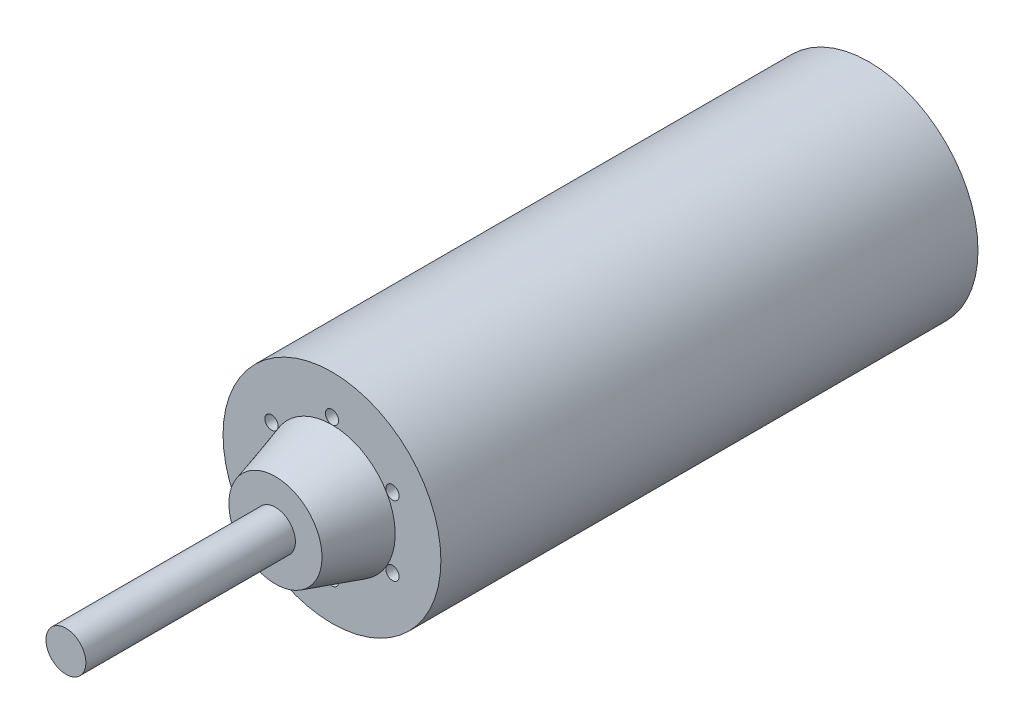
ISO-10303-21;
HEADER;
FILE_DESCRIPTION(('STEP AP214'),'2;1');
FILE_NAME('part.step','',(''),(''),'','','');
FILE_SCHEMA(('AUTOMOTIVE_DESIGN { 1 0 10303 214 1 1 1 1 }'));
ENDSEC;
DATA;
#1=APPLICATION_CONTEXT('core data for automotive mechanical design processes');
#2=APPLICATION_PROTOCOL_DEFINITION('international standard','automotive_design',2000,#1);
#3=PRODUCT_CONTEXT('',#1,'mechanical');
#4=PRODUCT('Part','Part','',(#3));
#5=PRODUCT_RELATED_PRODUCT_CATEGORY('part','',(#4));
#6=PRODUCT_DEFINITION_FORMATION('','',#4);
#7=PRODUCT_DEFINITION_CONTEXT('part definition',#1,'design');
#8=PRODUCT_DEFINITION('design','',#6,#7);
#9=PRODUCT_DEFINITION_SHAPE('','',#8);
#10=(LENGTH_UNIT() NAMED_UNIT(*) SI_UNIT(.MILLI.,.METRE.));
#11=(NAMED_UNIT(*) PLANE_ANGLE_UNIT() SI_UNIT($,.RADIAN.));
#12=(NAMED_UNIT(*) SI_UNIT($,.STERADIAN.) SOLID_ANGLE_UNIT());
#13=UNCERTAINTY_MEASURE_WITH_UNIT(LENGTH_MEASURE(1.E-05),#10,'distance_accuracy_value','');
#14=(GEOMETRIC_REPRESENTATION_CONTEXT(3) GLOBAL_UNCERTAINTY_ASSIGNED_CONTEXT((#13)) GLOBAL_UNIT_ASSIGNED_CONTEXT((#10,
#11,#12)) REPRESENTATION_CONTEXT('',''));
#15=CARTESIAN_POINT('',(0.,0.,0.));
#16=DIRECTION('',(0.,0.,1.));
#17=DIRECTION('',(1.,0.,0.));
#18=AXIS2_PLACEMENT_3D('',#15,#16,#17);
#19=CARTESIAN_POINT('',(0.,0.,-80.75));
#20=DIRECTION('',(0.,0.,1.));
#21=DIRECTION('',(1.,0.,0.));
#22=AXIS2_PLACEMENT_3D('',#19,#20,#21);
#23=CYLINDRICAL_SURFACE('',#22,32.75);
#24=CARTESIAN_POINT('',(0.,0.,-80.75));
#25=DIRECTION('',(0.,0.,1.));
#26=DIRECTION('',(1.,0.,0.));
#27=AXIS2_PLACEMENT_3D('',#24,#25,#26);
#28=CIRCLE('',#27,32.75);
#29=CARTESIAN_POINT('',(32.75,0.,-80.75));
#30=VERTEX_POINT('',#29);
#31=EDGE_CURVE('E83',#30,#30,#28,.T.);
#32=ORIENTED_EDGE('',*,*,#31,.T.);
#33=EDGE_LOOP('',(#32));
#34=FACE_BOUND('',#33,.T.);
#35=CARTESIAN_POINT('',(0.,0.,80.75));
#36=DIRECTION('',(0.,0.,1.));
#37=DIRECTION('',(1.,0.,0.));
#38=AXIS2_PLACEMENT_3D('',#35,#36,#37);
#39=CIRCLE('',#38,32.75);
#40=CARTESIAN_POINT('',(32.75,0.,80.75));
#41=VERTEX_POINT('',#40);
#42=EDGE_CURVE('E41',#41,#41,#39,.T.);
#43=ORIENTED_EDGE('',*,*,#42,.F.);
#44=EDGE_LOOP('',(#43));
#45=FACE_BOUND('',#44,.T.);
#46=ADVANCED_FACE('F38',(#34,#45),#23,.T.);
#47=CARTESIAN_POINT('',(0.,0.,-80.75));
#48=DIRECTION('',(0.,0.,1.));
#49=DIRECTION('',(1.,0.,0.));
#50=AXIS2_PLACEMENT_3D('',#47,#48,#49);
#51=PLANE('',#50);
#52=CARTESIAN_POINT('',(-14.8492424049174,-14.8492424049175,-80.75));
#53=DIRECTION('',(0.,0.,-1.));
#54=DIRECTION('',(0.,-1.,0.));
#55=AXIS2_PLACEMENT_3D('',#52,#53,#54);
#56=CIRCLE('',#55,2.5);
#57=CARTESIAN_POINT('',(-14.8492424049174,-17.3492424049175,-80.75));
#58=VERTEX_POINT('',#57);
#59=EDGE_CURVE('E226',#58,#58,#56,.T.);
#60=ORIENTED_EDGE('',*,*,#59,.F.);
#61=EDGE_LOOP('',(#60));
#62=FACE_BOUND('',#61,.T.);
#63=CARTESIAN_POINT('',(14.8492424049175,-14.8492424049175,-80.75));
#64=DIRECTION('',(0.,0.,-1.));
#65=DIRECTION('',(1.,0.,0.));
#66=AXIS2_PLACEMENT_3D('',#63,#64,#65);
#67=CIRCLE('',#66,2.5);
#68=CARTESIAN_POINT('',(17.3492424049175,-14.8492424049175,-80.75));
#69=VERTEX_POINT('',#68);
#70=EDGE_CURVE('E237',#69,#69,#67,.T.);
#71=ORIENTED_EDGE('',*,*,#70,.F.);
#72=EDGE_LOOP('',(#71));
#73=FACE_BOUND('',#72,.T.);
#74=CARTESIAN_POINT('',(14.8492424049173,14.8492424049177,-80.75));
#75=DIRECTION('',(0.,0.,-1.));
#76=DIRECTION('',(0.,1.,0.));
#77=AXIS2_PLACEMENT_3D('',#74,#75,#76);
#78=CIRCLE('',#77,2.5);
#79=CARTESIAN_POINT('',(14.8492424049173,17.3492424049177,-80.75));
#80=VERTEX_POINT('',#79);
#81=EDGE_CURVE('E243',#80,#80,#78,.T.);
#82=ORIENTED_EDGE('',*,*,#81,.F.);
#83=EDGE_LOOP('',(#82));
#84=FACE_BOUND('',#83,.T.);
#85=CARTESIAN_POINT('',(-14.8492424049175,14.8492424049175,-80.75));
#86=DIRECTION('',(0.,0.,-1.));
#87=DIRECTION('',(-1.,0.,0.));
#88=AXIS2_PLACEMENT_3D('',#85,#86,#87);
#89=CIRCLE('',#88,2.5);
#90=CARTESIAN_POINT('',(-17.3492424049175,14.8492424049175,-80.75));
#91=VERTEX_POINT('',#90);
#92=EDGE_CURVE('E225',#91,#91,#89,.T.);
#93=ORIENTED_EDGE('',*,*,#92,.F.);
#94=EDGE_LOOP('',(#93));
#95=FACE_BOUND('',#94,.T.);
#96=ORIENTED_EDGE('',*,*,#31,.F.);
#97=EDGE_LOOP('',(#96));
#98=FACE_BOUND('',#97,.T.);
#99=ADVANCED_FACE('F113',(#62,#73,#84,#95,#98),#51,.F.);
#100=CARTESIAN_POINT('',(0.,0.,80.75));
#101=DIRECTION('',(0.,0.,1.));
#102=DIRECTION('',(1.,0.,0.));
#103=AXIS2_PLACEMENT_3D('',#100,#101,#102);
#104=PLANE('',#103);
#105=CARTESIAN_POINT('',(0.,0.,80.75));
#106=DIRECTION('',(0.,0.,1.));
#107=DIRECTION('',(1.,0.,0.));
#108=AXIS2_PLACEMENT_3D('',#105,#106,#107);
#109=CIRCLE('',#108,19.);
#110=CARTESIAN_POINT('',(16.4544826719042,9.50000000000025,80.75));
#111=VERTEX_POINT('',#110);
#112=CARTESIAN_POINT('',(0.,19.,80.75));
#113=VERTEX_POINT('',#112);
#114=EDGE_CURVE('E73',#111,#113,#109,.T.);
#115=ORIENTED_EDGE('',*,*,#114,.F.);
#116=CARTESIAN_POINT('',(18.1865334794731,10.5000000000003,80.75));
#117=DIRECTION('',(0.,0.,1.));
#118=DIRECTION('',(0.50000000000001,-0.866025403784433,0.));
#119=AXIS2_PLACEMENT_3D('',#116,#117,#118);
#120=CIRCLE('',#119,2.);
#121=EDGE_CURVE('E52',#111,#111,#120,.T.);
#122=ORIENTED_EDGE('',*,*,#121,.F.);
#123=CARTESIAN_POINT('',(16.4544826719045,-9.49999999999979,80.75));
#124=VERTEX_POINT('',#123);
#125=EDGE_CURVE('E80',#124,#111,#109,.T.);
#126=ORIENTED_EDGE('',*,*,#125,.F.);
#127=CARTESIAN_POINT('',(18.1865334794733,-10.4999999999998,80.75));
#128=DIRECTION('',(0.,0.,1.));
#129=DIRECTION('',(-0.499999999999992,-0.866025403784443,0.));
#130=AXIS2_PLACEMENT_3D('',#127,#128,#129);
#131=CIRCLE('',#130,2.);
#132=EDGE_CURVE('E57',#124,#124,#131,.T.);
#133=ORIENTED_EDGE('',*,*,#132,.F.);
#134=CARTESIAN_POINT('',(0.,-19.,80.75));
#135=VERTEX_POINT('',#134);
#136=EDGE_CURVE('E272',#135,#124,#109,.T.);
#137=ORIENTED_EDGE('',*,*,#136,.F.);
#138=CARTESIAN_POINT('',(0.,-21.,80.75));
#139=DIRECTION('',(0.,0.,1.));
#140=DIRECTION('',(-1.,0.,0.));
#141=AXIS2_PLACEMENT_3D('',#138,#139,#140);
#142=CIRCLE('',#141,2.);
#143=EDGE_CURVE('E256',#135,#135,#142,.T.);
#144=ORIENTED_EDGE('',*,*,#143,.F.);
#145=CARTESIAN_POINT('',(-16.4544826719043,-9.50000000000014,80.75));
#146=VERTEX_POINT('',#145);
#147=EDGE_CURVE('E271',#146,#135,#109,.T.);
#148=ORIENTED_EDGE('',*,*,#147,.F.);
#149=CARTESIAN_POINT('',(-18.1865334794731,-10.5000000000001,80.75));
#150=DIRECTION('',(0.,0.,1.));
#151=DIRECTION('',(-0.500000000000004,0.866025403784436,0.));
#152=AXIS2_PLACEMENT_3D('',#149,#150,#151);
#153=CIRCLE('',#152,2.);
#154=EDGE_CURVE('E251',#146,#146,#153,.T.);
#155=ORIENTED_EDGE('',*,*,#154,.F.);
#156=CARTESIAN_POINT('',(-16.4544826719044,9.49999999999991,80.75));
#157=VERTEX_POINT('',#156);
#158=EDGE_CURVE('E102',#157,#146,#109,.T.);
#159=ORIENTED_EDGE('',*,*,#158,.F.);
#160=CARTESIAN_POINT('',(-18.1865334794733,10.4999999999999,80.75));
#161=DIRECTION('',(0.,0.,1.));
#162=DIRECTION('',(0.499999999999998,0.86602540378444,0.));
#163=AXIS2_PLACEMENT_3D('',#160,#161,#162);
#164=CIRCLE('',#163,2.);
#165=EDGE_CURVE('E95',#157,#157,#164,.T.);
#166=ORIENTED_EDGE('',*,*,#165,.F.);
#167=EDGE_CURVE('E46',#113,#157,#109,.T.);
#168=ORIENTED_EDGE('',*,*,#167,.F.);
#169=CARTESIAN_POINT('',(0.,21.,80.75));
#170=DIRECTION('',(0.,0.,1.));
#171=DIRECTION('',(1.,0.,0.));
#172=AXIS2_PLACEMENT_3D('',#169,#170,#171);
#173=CIRCLE('',#172,2.);
#174=EDGE_CURVE('E86',#113,#113,#173,.T.);
#175=ORIENTED_EDGE('',*,*,#174,.F.);
#176=EDGE_LOOP('',(#115,#122,#126,#133,#137,#144,#148,#155,#159,#166,#168,#175));
#177=FACE_BOUND('',#176,.T.);
#178=ORIENTED_EDGE('',*,*,#42,.T.);
#179=EDGE_LOOP('',(#178));
#180=FACE_BOUND('',#179,.T.);
#181=ADVANCED_FACE('F110',(#177,#180),#104,.T.);
#182=CARTESIAN_POINT('',(0.,0.,97.75));
#183=DIRECTION('',(0.,0.,-1.));
#184=DIRECTION('',(-1.,0.,0.));
#185=AXIS2_PLACEMENT_3D('',#182,#183,#184);
#186=PLANE('',#185);
#187=CARTESIAN_POINT('',(0.,0.,97.75));
#188=DIRECTION('',(0.,0.,1.));
#189=DIRECTION('',(1.,0.,0.));
#190=AXIS2_PLACEMENT_3D('',#187,#188,#189);
#191=CIRCLE('',#190,6.);
#192=CARTESIAN_POINT('',(6.,0.,97.75));
#193=VERTEX_POINT('',#192);
#194=EDGE_CURVE('E11',#193,#193,#191,.T.);
#195=ORIENTED_EDGE('',*,*,#194,.F.);
#196=EDGE_LOOP('',(#195));
#197=FACE_BOUND('',#196,.T.);
#198=CARTESIAN_POINT('',(0.,0.,97.75));
#199=DIRECTION('',(0.,0.,1.));
#200=DIRECTION('',(1.,0.,0.));
#201=AXIS2_PLACEMENT_3D('',#198,#199,#200);
#202=CIRCLE('',#201,14.);
#203=CARTESIAN_POINT('',(14.,0.,97.75));
#204=VERTEX_POINT('',#203);
#205=EDGE_CURVE('E100',#204,#204,#202,.T.);
#206=ORIENTED_EDGE('',*,*,#205,.T.);
#207=EDGE_LOOP('',(#206));
#208=FACE_BOUND('',#207,.T.);
#209=ADVANCED_FACE('F124',(#197,#208),#186,.F.);
#210=CARTESIAN_POINT('',(0.,0.,80.75));
#211=DIRECTION('',(0.,0.,-1.));
#212=DIRECTION('',(-1.,0.,0.));
#213=AXIS2_PLACEMENT_3D('',#210,#211,#212);
#214=CONICAL_SURFACE('',#213,19.,0.286051441717318);
#215=ORIENTED_EDGE('',*,*,#205,.F.);
#216=EDGE_LOOP('',(#215));
#217=FACE_BOUND('',#216,.T.);
#218=ORIENTED_EDGE('',*,*,#167,.T.);
#219=ORIENTED_EDGE('',*,*,#158,.T.);
#220=ORIENTED_EDGE('',*,*,#147,.T.);
#221=ORIENTED_EDGE('',*,*,#136,.T.);
#222=ORIENTED_EDGE('',*,*,#125,.T.);
#223=ORIENTED_EDGE('',*,*,#114,.T.);
#224=EDGE_LOOP('',(#218,#219,#220,#221,#222,#223));
#225=FACE_BOUND('',#224,.T.);
#226=ADVANCED_FACE('F75',(#217,#225),#214,.T.);
#227=CARTESIAN_POINT('',(0.,0.,160.75));
#228=DIRECTION('',(0.,0.,-1.));
#229=DIRECTION('',(-1.,0.,0.));
#230=AXIS2_PLACEMENT_3D('',#227,#228,#229);
#231=CYLINDRICAL_SURFACE('',#230,6.);
#232=CARTESIAN_POINT('',(0.,0.,160.75));
#233=DIRECTION('',(0.,0.,1.));
#234=DIRECTION('',(1.,0.,0.));
#235=AXIS2_PLACEMENT_3D('',#232,#233,#234);
#236=CIRCLE('',#235,6.);
#237=CARTESIAN_POINT('',(6.,0.,160.75));
#238=VERTEX_POINT('',#237);
#239=EDGE_CURVE('E92',#238,#238,#236,.T.);
#240=ORIENTED_EDGE('',*,*,#239,.F.);
#241=EDGE_LOOP('',(#240));
#242=FACE_BOUND('',#241,.T.);
#243=ORIENTED_EDGE('',*,*,#194,.T.);
#244=EDGE_LOOP('',(#243));
#245=FACE_BOUND('',#244,.T.);
#246=ADVANCED_FACE('F133',(#242,#245),#231,.T.);
#247=CARTESIAN_POINT('',(0.,0.,160.75));
#248=DIRECTION('',(0.,0.,1.));
#249=DIRECTION('',(1.,0.,0.));
#250=AXIS2_PLACEMENT_3D('',#247,#248,#249);
#251=PLANE('',#250);
#252=ORIENTED_EDGE('',*,*,#239,.T.);
#253=EDGE_LOOP('',(#252));
#254=FACE_BOUND('',#253,.T.);
#255=ADVANCED_FACE('F137',(#254),#251,.T.);
#256=CARTESIAN_POINT('',(0.,21.,70.75));
#257=DIRECTION('',(0.,0.,1.));
#258=DIRECTION('',(1.,0.,0.));
#259=AXIS2_PLACEMENT_3D('',#256,#257,#258);
#260=CYLINDRICAL_SURFACE('',#259,2.);
#261=CARTESIAN_POINT('',(0.,21.,70.75));
#262=DIRECTION('',(0.,0.,1.));
#263=DIRECTION('',(1.,0.,0.));
#264=AXIS2_PLACEMENT_3D('',#261,#262,#263);
#265=CIRCLE('',#264,2.);
#266=CARTESIAN_POINT('',(1.99999999999993,21.,70.75));
#267=VERTEX_POINT('',#266);
#268=EDGE_CURVE('E88',#267,#267,#265,.T.);
#269=ORIENTED_EDGE('',*,*,#268,.F.);
#270=EDGE_LOOP('',(#269));
#271=FACE_BOUND('',#270,.T.);
#272=ORIENTED_EDGE('',*,*,#174,.T.);
#273=EDGE_LOOP('',(#272));
#274=FACE_BOUND('',#273,.T.);
#275=ADVANCED_FACE('F87',(#271,#274),#260,.F.);
#276=CARTESIAN_POINT('',(0.,21.,70.75));
#277=DIRECTION('',(0.,0.,1.));
#278=DIRECTION('',(1.,0.,0.));
#279=AXIS2_PLACEMENT_3D('',#276,#277,#278);
#280=PLANE('',#279);
#281=ORIENTED_EDGE('',*,*,#268,.T.);
#282=EDGE_LOOP('',(#281));
#283=FACE_BOUND('',#282,.T.);
#284=ADVANCED_FACE('F144',(#283),#280,.T.);
#285=CARTESIAN_POINT('',(-18.1865334794733,10.4999999999999,70.75));
#286=DIRECTION('',(0.,0.,1.));
#287=DIRECTION('',(1.,0.,0.));
#288=AXIS2_PLACEMENT_3D('',#285,#286,#287);
#289=CYLINDRICAL_SURFACE('',#288,2.);
#290=CARTESIAN_POINT('',(-18.1865334794733,10.4999999999999,70.75));
#291=DIRECTION('',(0.,0.,1.));
#292=DIRECTION('',(0.499999999999998,0.86602540378444,0.));
#293=AXIS2_PLACEMENT_3D('',#290,#291,#292);
#294=CIRCLE('',#293,2.);
#295=CARTESIAN_POINT('',(-17.1865334794733,12.2320508075688,70.75));
#296=VERTEX_POINT('',#295);
#297=EDGE_CURVE('E89',#296,#296,#294,.T.);
#298=ORIENTED_EDGE('',*,*,#297,.F.);
#299=EDGE_LOOP('',(#298));
#300=FACE_BOUND('',#299,.T.);
#301=ORIENTED_EDGE('',*,*,#165,.T.);
#302=EDGE_LOOP('',(#301));
#303=FACE_BOUND('',#302,.T.);
#304=ADVANCED_FACE('F148',(#300,#303),#289,.F.);
#305=CARTESIAN_POINT('',(-18.1865334794733,10.4999999999999,70.75));
#306=DIRECTION('',(0.,0.,1.));
#307=DIRECTION('',(0.499999999999998,0.86602540378444,0.));
#308=AXIS2_PLACEMENT_3D('',#305,#306,#307);
#309=PLANE('',#308);
#310=ORIENTED_EDGE('',*,*,#297,.T.);
#311=EDGE_LOOP('',(#310));
#312=FACE_BOUND('',#311,.T.);
#313=ADVANCED_FACE('F152',(#312),#309,.T.);
#314=CARTESIAN_POINT('',(-18.1865334794731,-10.5000000000001,70.75));
#315=DIRECTION('',(0.,0.,1.));
#316=DIRECTION('',(1.,0.,0.));
#317=AXIS2_PLACEMENT_3D('',#314,#315,#316);
#318=CYLINDRICAL_SURFACE('',#317,2.);
#319=CARTESIAN_POINT('',(-18.1865334794731,-10.5000000000001,70.75));
#320=DIRECTION('',(0.,0.,1.));
#321=DIRECTION('',(-0.500000000000004,0.866025403784436,0.));
#322=AXIS2_PLACEMENT_3D('',#319,#320,#321);
#323=CIRCLE('',#322,2.);
#324=CARTESIAN_POINT('',(-19.1865334794731,-8.76794919243128,70.75));
#325=VERTEX_POINT('',#324);
#326=EDGE_CURVE('E248',#325,#325,#323,.T.);
#327=ORIENTED_EDGE('',*,*,#326,.F.);
#328=EDGE_LOOP('',(#327));
#329=FACE_BOUND('',#328,.T.);
#330=ORIENTED_EDGE('',*,*,#154,.T.);
#331=EDGE_LOOP('',(#330));
#332=FACE_BOUND('',#331,.T.);
#333=ADVANCED_FACE('F156',(#329,#332),#318,.F.);
#334=CARTESIAN_POINT('',(-18.1865334794731,-10.5000000000001,70.75));
#335=DIRECTION('',(0.,0.,1.));
#336=DIRECTION('',(-0.500000000000004,0.866025403784436,0.));
#337=AXIS2_PLACEMENT_3D('',#334,#335,#336);
#338=PLANE('',#337);
#339=ORIENTED_EDGE('',*,*,#326,.T.);
#340=EDGE_LOOP('',(#339));
#341=FACE_BOUND('',#340,.T.);
#342=ADVANCED_FACE('F179',(#341),#338,.T.);
#343=CARTESIAN_POINT('',(0.,-21.,70.75));
#344=DIRECTION('',(0.,0.,1.));
#345=DIRECTION('',(1.,0.,0.));
#346=AXIS2_PLACEMENT_3D('',#343,#344,#345);
#347=CYLINDRICAL_SURFACE('',#346,2.);
#348=CARTESIAN_POINT('',(0.,-21.,70.75));
#349=DIRECTION('',(0.,0.,1.));
#350=DIRECTION('',(-1.,0.,0.));
#351=AXIS2_PLACEMENT_3D('',#348,#349,#350);
#352=CIRCLE('',#351,2.);
#353=CARTESIAN_POINT('',(-1.99999999999993,-21.,70.75));
#354=VERTEX_POINT('',#353);
#355=EDGE_CURVE('E253',#354,#354,#352,.T.);
#356=ORIENTED_EDGE('',*,*,#355,.F.);
#357=EDGE_LOOP('',(#356));
#358=FACE_BOUND('',#357,.T.);
#359=ORIENTED_EDGE('',*,*,#143,.T.);
#360=EDGE_LOOP('',(#359));
#361=FACE_BOUND('',#360,.T.);
#362=ADVANCED_FACE('F176',(#358,#361),#347,.F.);
#363=CARTESIAN_POINT('',(0.,-21.,70.75));
#364=DIRECTION('',(0.,0.,1.));
#365=DIRECTION('',(-1.,0.,0.));
#366=AXIS2_PLACEMENT_3D('',#363,#364,#365);
#367=PLANE('',#366);
#368=ORIENTED_EDGE('',*,*,#355,.T.);
#369=EDGE_LOOP('',(#368));
#370=FACE_BOUND('',#369,.T.);
#371=ADVANCED_FACE('F171',(#370),#367,.T.);
#372=CARTESIAN_POINT('',(18.1865334794733,-10.4999999999998,70.75));
#373=DIRECTION('',(0.,0.,1.));
#374=DIRECTION('',(1.,0.,0.));
#375=AXIS2_PLACEMENT_3D('',#372,#373,#374);
#376=CYLINDRICAL_SURFACE('',#375,2.);
#377=CARTESIAN_POINT('',(18.1865334794733,-10.4999999999998,70.75));
#378=DIRECTION('',(0.,0.,1.));
#379=DIRECTION('',(-0.499999999999992,-0.866025403784443,0.));
#380=AXIS2_PLACEMENT_3D('',#377,#378,#379);
#381=CIRCLE('',#380,2.);
#382=CARTESIAN_POINT('',(17.1865334794734,-12.2320508075687,70.75));
#383=VERTEX_POINT('',#382);
#384=EDGE_CURVE('E258',#383,#383,#381,.T.);
#385=ORIENTED_EDGE('',*,*,#384,.F.);
#386=EDGE_LOOP('',(#385));
#387=FACE_BOUND('',#386,.T.);
#388=ORIENTED_EDGE('',*,*,#132,.T.);
#389=EDGE_LOOP('',(#388));
#390=FACE_BOUND('',#389,.T.);
#391=ADVANCED_FACE('F168',(#387,#390),#376,.F.);
#392=CARTESIAN_POINT('',(18.1865334794733,-10.4999999999998,70.75));
#393=DIRECTION('',(0.,0.,1.));
#394=DIRECTION('',(-0.499999999999992,-0.866025403784443,0.));
#395=AXIS2_PLACEMENT_3D('',#392,#393,#394);
#396=PLANE('',#395);
#397=ORIENTED_EDGE('',*,*,#384,.T.);
#398=EDGE_LOOP('',(#397));
#399=FACE_BOUND('',#398,.T.);
#400=ADVANCED_FACE('F162',(#399),#396,.T.);
#401=CARTESIAN_POINT('',(18.1865334794731,10.5000000000003,70.75));
#402=DIRECTION('',(0.,0.,1.));
#403=DIRECTION('',(1.,0.,0.));
#404=AXIS2_PLACEMENT_3D('',#401,#402,#403);
#405=CYLINDRICAL_SURFACE('',#404,2.);
#406=CARTESIAN_POINT('',(18.1865334794731,10.5000000000003,70.75));
#407=DIRECTION('',(0.,0.,1.));
#408=DIRECTION('',(0.50000000000001,-0.866025403784433,0.));
#409=AXIS2_PLACEMENT_3D('',#406,#407,#408);
#410=CIRCLE('',#409,2.);
#411=CARTESIAN_POINT('',(19.1865334794731,8.76794919243141,70.75));
#412=VERTEX_POINT('',#411);
#413=EDGE_CURVE('E262',#412,#412,#410,.T.);
#414=ORIENTED_EDGE('',*,*,#413,.F.);
#415=EDGE_LOOP('',(#414));
#416=FACE_BOUND('',#415,.T.);
#417=ORIENTED_EDGE('',*,*,#121,.T.);
#418=EDGE_LOOP('',(#417));
#419=FACE_BOUND('',#418,.T.);
#420=ADVANCED_FACE('F158',(#416,#419),#405,.F.);
#421=CARTESIAN_POINT('',(18.1865334794731,10.5000000000003,70.75));
#422=DIRECTION('',(0.,0.,1.));
#423=DIRECTION('',(0.50000000000001,-0.866025403784433,0.));
#424=AXIS2_PLACEMENT_3D('',#421,#422,#423);
#425=PLANE('',#424);
#426=ORIENTED_EDGE('',*,*,#413,.T.);
#427=EDGE_LOOP('',(#426));
#428=FACE_BOUND('',#427,.T.);
#429=ADVANCED_FACE('F161',(#428),#425,.T.);
#430=CARTESIAN_POINT('',(-14.8492424049175,14.8492424049175,-70.75));
#431=DIRECTION('',(0.,0.,-1.));
#432=DIRECTION('',(-1.,0.,0.));
#433=AXIS2_PLACEMENT_3D('',#430,#431,#432);
#434=CYLINDRICAL_SURFACE('',#433,2.5);
#435=CARTESIAN_POINT('',(-14.8492424049175,14.8492424049175,-70.75));
#436=DIRECTION('',(0.,0.,-1.));
#437=DIRECTION('',(-1.,0.,0.));
#438=AXIS2_PLACEMENT_3D('',#435,#436,#437);
#439=CIRCLE('',#438,2.5);
#440=CARTESIAN_POINT('',(-17.3492424049175,14.8492424049175,-70.75));
#441=VERTEX_POINT('',#440);
#442=EDGE_CURVE('E229',#441,#441,#439,.T.);
#443=ORIENTED_EDGE('',*,*,#442,.F.);
#444=EDGE_LOOP('',(#443));
#445=FACE_BOUND('',#444,.T.);
#446=ORIENTED_EDGE('',*,*,#92,.T.);
#447=EDGE_LOOP('',(#446));
#448=FACE_BOUND('',#447,.T.);
#449=ADVANCED_FACE('F166',(#445,#448),#434,.F.);
#450=CARTESIAN_POINT('',(-14.8492424049175,14.8492424049175,-70.75));
#451=DIRECTION('',(0.,0.,-1.));
#452=DIRECTION('',(-1.,0.,0.));
#453=AXIS2_PLACEMENT_3D('',#450,#451,#452);
#454=PLANE('',#453);
#455=ORIENTED_EDGE('',*,*,#442,.T.);
#456=EDGE_LOOP('',(#455));
#457=FACE_BOUND('',#456,.T.);
#458=ADVANCED_FACE('F192',(#457),#454,.T.);
#459=CARTESIAN_POINT('',(14.8492424049173,14.8492424049177,-70.75));
#460=DIRECTION('',(0.,0.,-1.));
#461=DIRECTION('',(-1.,0.,0.));
#462=AXIS2_PLACEMENT_3D('',#459,#460,#461);
#463=CYLINDRICAL_SURFACE('',#462,2.5);
#464=CARTESIAN_POINT('',(14.8492424049173,14.8492424049177,-70.75));
#465=DIRECTION('',(0.,0.,-1.));
#466=DIRECTION('',(0.,1.,0.));
#467=AXIS2_PLACEMENT_3D('',#464,#465,#466);
#468=CIRCLE('',#467,2.5);
#469=CARTESIAN_POINT('',(14.8492424049173,17.3492424049177,-70.75));
#470=VERTEX_POINT('',#469);
#471=EDGE_CURVE('E240',#470,#470,#468,.T.);
#472=ORIENTED_EDGE('',*,*,#471,.F.);
#473=EDGE_LOOP('',(#472));
#474=FACE_BOUND('',#473,.T.);
#475=ORIENTED_EDGE('',*,*,#81,.T.);
#476=EDGE_LOOP('',(#475));
#477=FACE_BOUND('',#476,.T.);
#478=ADVANCED_FACE('F196',(#474,#477),#463,.F.);
#479=CARTESIAN_POINT('',(14.8492424049173,14.8492424049177,-70.75));
#480=DIRECTION('',(0.,0.,-1.));
#481=DIRECTION('',(0.,1.,0.));
#482=AXIS2_PLACEMENT_3D('',#479,#480,#481);
#483=PLANE('',#482);
#484=ORIENTED_EDGE('',*,*,#471,.T.);
#485=EDGE_LOOP('',(#484));
#486=FACE_BOUND('',#485,.T.);
#487=ADVANCED_FACE('F200',(#486),#483,.T.);
#488=CARTESIAN_POINT('',(14.8492424049175,-14.8492424049175,-70.75));
#489=DIRECTION('',(0.,0.,-1.));
#490=DIRECTION('',(-1.,0.,0.));
#491=AXIS2_PLACEMENT_3D('',#488,#489,#490);
#492=CYLINDRICAL_SURFACE('',#491,2.5);
#493=CARTESIAN_POINT('',(14.8492424049175,-14.8492424049175,-70.75));
#494=DIRECTION('',(0.,0.,-1.));
#495=DIRECTION('',(1.,0.,0.));
#496=AXIS2_PLACEMENT_3D('',#493,#494,#495);
#497=CIRCLE('',#496,2.5);
#498=CARTESIAN_POINT('',(17.3492424049175,-14.8492424049175,-70.75));
#499=VERTEX_POINT('',#498);
#500=EDGE_CURVE('E232',#499,#499,#497,.T.);
#501=ORIENTED_EDGE('',*,*,#500,.F.);
#502=EDGE_LOOP('',(#501));
#503=FACE_BOUND('',#502,.T.);
#504=ORIENTED_EDGE('',*,*,#70,.T.);
#505=EDGE_LOOP('',(#504));
#506=FACE_BOUND('',#505,.T.);
#507=ADVANCED_FACE('F204',(#503,#506),#492,.F.);
#508=CARTESIAN_POINT('',(14.8492424049175,-14.8492424049175,-70.75));
#509=DIRECTION('',(0.,0.,-1.));
#510=DIRECTION('',(1.,0.,0.));
#511=AXIS2_PLACEMENT_3D('',#508,#509,#510);
#512=PLANE('',#511);
#513=ORIENTED_EDGE('',*,*,#500,.T.);
#514=EDGE_LOOP('',(#513));
#515=FACE_BOUND('',#514,.T.);
#516=ADVANCED_FACE('F208',(#515),#512,.T.);
#517=CARTESIAN_POINT('',(-14.8492424049174,-14.8492424049175,-70.75));
#518=DIRECTION('',(0.,0.,-1.));
#519=DIRECTION('',(-1.,0.,0.));
#520=AXIS2_PLACEMENT_3D('',#517,#518,#519);
#521=CYLINDRICAL_SURFACE('',#520,2.5);
#522=CARTESIAN_POINT('',(-14.8492424049174,-14.8492424049175,-70.75));
#523=DIRECTION('',(0.,0.,-1.));
#524=DIRECTION('',(0.,-1.,0.));
#525=AXIS2_PLACEMENT_3D('',#522,#523,#524);
#526=CIRCLE('',#525,2.5);
#527=CARTESIAN_POINT('',(-14.8492424049174,-17.3492424049175,-70.75));
#528=VERTEX_POINT('',#527);
#529=EDGE_CURVE('E224',#528,#528,#526,.T.);
#530=ORIENTED_EDGE('',*,*,#529,.F.);
#531=EDGE_LOOP('',(#530));
#532=FACE_BOUND('',#531,.T.);
#533=ORIENTED_EDGE('',*,*,#59,.T.);
#534=EDGE_LOOP('',(#533));
#535=FACE_BOUND('',#534,.T.);
#536=ADVANCED_FACE('F212',(#532,#535),#521,.F.);
#537=CARTESIAN_POINT('',(-14.8492424049174,-14.8492424049175,-70.75));
#538=DIRECTION('',(0.,0.,-1.));
#539=DIRECTION('',(0.,-1.,0.));
#540=AXIS2_PLACEMENT_3D('',#537,#538,#539);
#541=PLANE('',#540);
#542=ORIENTED_EDGE('',*,*,#529,.T.);
#543=EDGE_LOOP('',(#542));
#544=FACE_BOUND('',#543,.T.);
#545=ADVANCED_FACE('F216',(#544),#541,.T.);
#546=CLOSED_SHELL('',(#46,#99,#181,#209,#226,#246,#255,#275,#284,#304,#313,#333,#342,#362,#371,
#391,#400,#420,#429,#449,#458,#478,#487,#507,#516,#536,#545));
#547=MANIFOLD_SOLID_BREP('B2',#546);
#548=ADVANCED_BREP_SHAPE_REPRESENTATION('',(#18,#547),#14);
#549=SHAPE_DEFINITION_REPRESENTATION(#9,#548);
ENDSEC;
END-ISO-10303-21;
